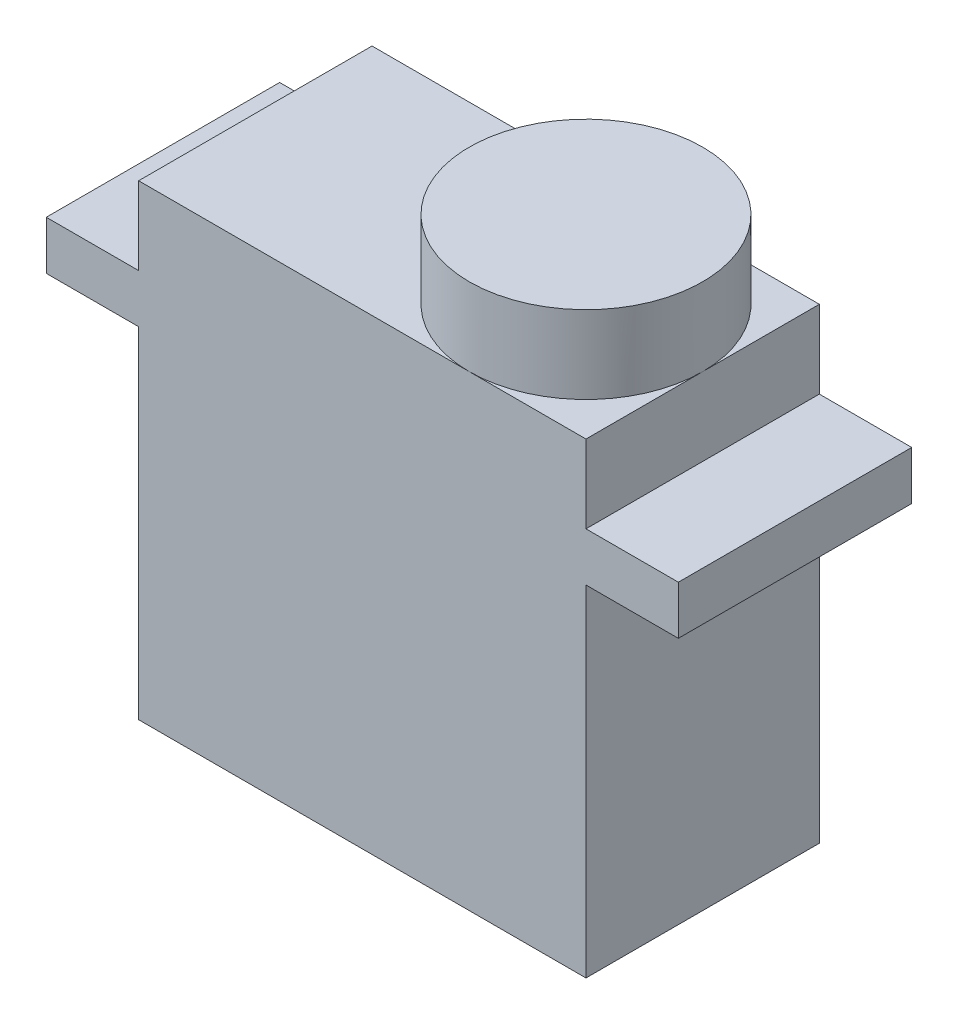
ISO-10303-21;
HEADER;
FILE_DESCRIPTION(('STEP AP214'),'2;1');
FILE_NAME('part.step','',(''),(''),'','','');
FILE_SCHEMA(('AUTOMOTIVE_DESIGN { 1 0 10303 214 1 1 1 1 }'));
ENDSEC;
DATA;
#1=APPLICATION_CONTEXT('core data for automotive mechanical design processes');
#2=APPLICATION_PROTOCOL_DEFINITION('international standard','automotive_design',2000,#1);
#3=PRODUCT_CONTEXT('',#1,'mechanical');
#4=PRODUCT('Part','Part','',(#3));
#5=PRODUCT_RELATED_PRODUCT_CATEGORY('part','',(#4));
#6=PRODUCT_DEFINITION_FORMATION('','',#4);
#7=PRODUCT_DEFINITION_CONTEXT('part definition',#1,'design');
#8=PRODUCT_DEFINITION('design','',#6,#7);
#9=PRODUCT_DEFINITION_SHAPE('','',#8);
#10=(LENGTH_UNIT() NAMED_UNIT(*) SI_UNIT(.MILLI.,.METRE.));
#11=(NAMED_UNIT(*) PLANE_ANGLE_UNIT() SI_UNIT($,.RADIAN.));
#12=(NAMED_UNIT(*) SI_UNIT($,.STERADIAN.) SOLID_ANGLE_UNIT());
#13=UNCERTAINTY_MEASURE_WITH_UNIT(LENGTH_MEASURE(1.E-05),#10,'distance_accuracy_value','');
#14=(GEOMETRIC_REPRESENTATION_CONTEXT(3) GLOBAL_UNCERTAINTY_ASSIGNED_CONTEXT((#13)) GLOBAL_UNIT_ASSIGNED_CONTEXT((#10,
#11,#12)) REPRESENTATION_CONTEXT('',''));
#15=CARTESIAN_POINT('',(0.,0.,0.));
#16=DIRECTION('',(0.,0.,1.));
#17=DIRECTION('',(1.,0.,0.));
#18=AXIS2_PLACEMENT_3D('',#15,#16,#17);
#19=CARTESIAN_POINT('',(11.5,24.,0.));
#20=DIRECTION('',(-1.,0.,0.));
#21=DIRECTION('',(0.,0.,1.));
#22=AXIS2_PLACEMENT_3D('',#19,#20,#21);
#23=PLANE('',#22);
#24=DIRECTION('',(0.,0.,-1.));
#25=VECTOR('',#24,1.);
#26=CARTESIAN_POINT('',(11.5,17.5,0.));
#27=LINE('',#26,#25);
#28=CARTESIAN_POINT('',(11.5,17.5,6.));
#29=VERTEX_POINT('',#28);
#30=CARTESIAN_POINT('',(11.5,17.5,-6.));
#31=VERTEX_POINT('',#30);
#32=EDGE_CURVE('E152',#29,#31,#27,.T.);
#33=ORIENTED_EDGE('',*,*,#32,.F.);
#34=DIRECTION('',(0.,-1.,0.));
#35=VECTOR('',#34,1.);
#36=CARTESIAN_POINT('',(11.5,24.,6.));
#37=LINE('',#36,#35);
#38=CARTESIAN_POINT('',(11.5,0.,6.));
#39=VERTEX_POINT('',#38);
#40=EDGE_CURVE('E161',#29,#39,#37,.T.);
#41=ORIENTED_EDGE('',*,*,#40,.T.);
#42=DIRECTION('',(0.,0.,-1.));
#43=VECTOR('',#42,1.);
#44=CARTESIAN_POINT('',(11.5,0.,0.));
#45=LINE('',#44,#43);
#46=CARTESIAN_POINT('',(11.5,0.,-6.));
#47=VERTEX_POINT('',#46);
#48=EDGE_CURVE('E218',#39,#47,#45,.T.);
#49=ORIENTED_EDGE('',*,*,#48,.T.);
#50=DIRECTION('',(0.,-1.,0.));
#51=VECTOR('',#50,1.);
#52=CARTESIAN_POINT('',(11.5,24.,-6.));
#53=LINE('',#52,#51);
#54=EDGE_CURVE('E233',#31,#47,#53,.T.);
#55=ORIENTED_EDGE('',*,*,#54,.F.);
#56=EDGE_LOOP('',(#33,#41,#49,#55));
#57=FACE_BOUND('',#56,.T.);
#58=ADVANCED_FACE('F39',(#57),#23,.F.);
#59=CARTESIAN_POINT('',(-11.5,24.,0.));
#60=DIRECTION('',(-1.,0.,0.));
#61=DIRECTION('',(0.,0.,1.));
#62=AXIS2_PLACEMENT_3D('',#59,#60,#61);
#63=PLANE('',#62);
#64=DIRECTION('',(0.,-1.,0.));
#65=VECTOR('',#64,1.);
#66=CARTESIAN_POINT('',(-11.5,24.,6.));
#67=LINE('',#66,#65);
#68=CARTESIAN_POINT('',(-11.5,17.5,6.));
#69=VERTEX_POINT('',#68);
#70=CARTESIAN_POINT('',(-11.5,0.,6.));
#71=VERTEX_POINT('',#70);
#72=EDGE_CURVE('E216',#69,#71,#67,.T.);
#73=ORIENTED_EDGE('',*,*,#72,.F.);
#74=DIRECTION('',(0.,0.,-1.));
#75=VECTOR('',#74,1.);
#76=CARTESIAN_POINT('',(-11.5,17.5,0.));
#77=LINE('',#76,#75);
#78=CARTESIAN_POINT('',(-11.5,17.5,-6.));
#79=VERTEX_POINT('',#78);
#80=EDGE_CURVE('E183',#69,#79,#77,.T.);
#81=ORIENTED_EDGE('',*,*,#80,.T.);
#82=DIRECTION('',(0.,-1.,0.));
#83=VECTOR('',#82,1.);
#84=CARTESIAN_POINT('',(-11.5,24.,-6.));
#85=LINE('',#84,#83);
#86=CARTESIAN_POINT('',(-11.5,0.,-6.));
#87=VERTEX_POINT('',#86);
#88=EDGE_CURVE('E230',#79,#87,#85,.T.);
#89=ORIENTED_EDGE('',*,*,#88,.T.);
#90=DIRECTION('',(0.,0.,-1.));
#91=VECTOR('',#90,1.);
#92=CARTESIAN_POINT('',(-11.5,0.,0.));
#93=LINE('',#92,#91);
#94=EDGE_CURVE('E224',#71,#87,#93,.T.);
#95=ORIENTED_EDGE('',*,*,#94,.F.);
#96=EDGE_LOOP('',(#73,#81,#89,#95));
#97=FACE_BOUND('',#96,.T.);
#98=ADVANCED_FACE('F249',(#97),#63,.T.);
#99=CARTESIAN_POINT('',(0.,24.,0.));
#100=DIRECTION('',(0.,1.,0.));
#101=DIRECTION('',(0.,0.,1.));
#102=AXIS2_PLACEMENT_3D('',#99,#100,#101);
#103=PLANE('',#102);
#104=CARTESIAN_POINT('',(5.5,24.,0.));
#105=DIRECTION('',(0.,1.,0.));
#106=DIRECTION('',(0.,0.,1.));
#107=AXIS2_PLACEMENT_3D('',#104,#105,#106);
#108=CIRCLE('',#107,6.);
#109=CARTESIAN_POINT('',(5.5,24.,6.));
#110=VERTEX_POINT('',#109);
#111=CARTESIAN_POINT('',(11.5,24.,0.));
#112=VERTEX_POINT('',#111);
#113=EDGE_CURVE('E50',#110,#112,#108,.T.);
#114=ORIENTED_EDGE('',*,*,#113,.F.);
#115=DIRECTION('',(1.,0.,0.));
#116=VECTOR('',#115,1.);
#117=CARTESIAN_POINT('',(0.,24.,6.));
#118=LINE('',#117,#116);
#119=CARTESIAN_POINT('',(11.5,24.,6.));
#120=VERTEX_POINT('',#119);
#121=EDGE_CURVE('E205',#110,#120,#118,.T.);
#122=ORIENTED_EDGE('',*,*,#121,.T.);
#123=DIRECTION('',(0.,0.,-1.));
#124=VECTOR('',#123,1.);
#125=CARTESIAN_POINT('',(11.5,24.,0.));
#126=LINE('',#125,#124);
#127=EDGE_CURVE('E206',#120,#112,#126,.T.);
#128=ORIENTED_EDGE('',*,*,#127,.T.);
#129=EDGE_LOOP('',(#114,#122,#128));
#130=FACE_BOUND('',#129,.T.);
#131=ADVANCED_FACE('F283',(#130),#103,.T.);
#132=CARTESIAN_POINT('',(5.5,24.,-6.));
#133=VERTEX_POINT('',#132);
#134=EDGE_CURVE('E11',#112,#133,#108,.T.);
#135=ORIENTED_EDGE('',*,*,#134,.F.);
#136=CARTESIAN_POINT('',(11.5,24.,-6.));
#137=VERTEX_POINT('',#136);
#138=EDGE_CURVE('E204',#112,#137,#126,.T.);
#139=ORIENTED_EDGE('',*,*,#138,.T.);
#140=DIRECTION('',(1.,0.,0.));
#141=VECTOR('',#140,1.);
#142=CARTESIAN_POINT('',(0.,24.,-6.));
#143=LINE('',#142,#141);
#144=EDGE_CURVE('E209',#133,#137,#143,.T.);
#145=ORIENTED_EDGE('',*,*,#144,.F.);
#146=EDGE_LOOP('',(#135,#139,#145));
#147=FACE_BOUND('',#146,.T.);
#148=ADVANCED_FACE('F272',(#147),#103,.T.);
#149=CARTESIAN_POINT('',(0.,24.,6.));
#150=DIRECTION('',(0.,0.,-1.));
#151=DIRECTION('',(-1.,0.,0.));
#152=AXIS2_PLACEMENT_3D('',#149,#150,#151);
#153=PLANE('',#152);
#154=DIRECTION('',(1.,0.,0.));
#155=VECTOR('',#154,1.);
#156=CARTESIAN_POINT('',(0.,0.,6.));
#157=LINE('',#156,#155);
#158=EDGE_CURVE('E199',#71,#39,#157,.T.);
#159=ORIENTED_EDGE('',*,*,#158,.T.);
#160=ORIENTED_EDGE('',*,*,#40,.F.);
#161=DIRECTION('',(1.,0.,0.));
#162=VECTOR('',#161,1.);
#163=CARTESIAN_POINT('',(0.,17.5,6.));
#164=LINE('',#163,#162);
#165=CARTESIAN_POINT('',(16.25,17.5,6.));
#166=VERTEX_POINT('',#165);
#167=EDGE_CURVE('E156',#29,#166,#164,.T.);
#168=ORIENTED_EDGE('',*,*,#167,.T.);
#169=DIRECTION('',(0.,1.,0.));
#170=VECTOR('',#169,1.);
#171=CARTESIAN_POINT('',(16.25,17.5,6.));
#172=LINE('',#171,#170);
#173=CARTESIAN_POINT('',(16.25,20.,6.));
#174=VERTEX_POINT('',#173);
#175=EDGE_CURVE('E141',#166,#174,#172,.T.);
#176=ORIENTED_EDGE('',*,*,#175,.T.);
#177=DIRECTION('',(1.,0.,0.));
#178=VECTOR('',#177,1.);
#179=CARTESIAN_POINT('',(0.,20.,6.));
#180=LINE('',#179,#178);
#181=CARTESIAN_POINT('',(11.5,20.,6.));
#182=VERTEX_POINT('',#181);
#183=EDGE_CURVE('E170',#182,#174,#180,.T.);
#184=ORIENTED_EDGE('',*,*,#183,.F.);
#185=EDGE_CURVE('E43',#120,#182,#37,.T.);
#186=ORIENTED_EDGE('',*,*,#185,.F.);
#187=ORIENTED_EDGE('',*,*,#121,.F.);
#188=CARTESIAN_POINT('',(-11.5,24.,6.));
#189=VERTEX_POINT('',#188);
#190=EDGE_CURVE('E202',#189,#110,#118,.T.);
#191=ORIENTED_EDGE('',*,*,#190,.F.);
#192=CARTESIAN_POINT('',(-11.5,20.,6.));
#193=VERTEX_POINT('',#192);
#194=EDGE_CURVE('E227',#189,#193,#67,.T.);
#195=ORIENTED_EDGE('',*,*,#194,.T.);
#196=DIRECTION('',(1.,0.,0.));
#197=VECTOR('',#196,1.);
#198=CARTESIAN_POINT('',(0.,20.,6.));
#199=LINE('',#198,#197);
#200=CARTESIAN_POINT('',(-16.25,20.,6.));
#201=VERTEX_POINT('',#200);
#202=EDGE_CURVE('E189',#201,#193,#199,.T.);
#203=ORIENTED_EDGE('',*,*,#202,.F.);
#204=DIRECTION('',(0.,1.,0.));
#205=VECTOR('',#204,1.);
#206=CARTESIAN_POINT('',(-16.25,17.5,6.));
#207=LINE('',#206,#205);
#208=CARTESIAN_POINT('',(-16.25,17.5,6.));
#209=VERTEX_POINT('',#208);
#210=EDGE_CURVE('E193',#209,#201,#207,.T.);
#211=ORIENTED_EDGE('',*,*,#210,.F.);
#212=DIRECTION('',(1.,0.,0.));
#213=VECTOR('',#212,1.);
#214=CARTESIAN_POINT('',(0.,17.5,6.));
#215=LINE('',#214,#213);
#216=EDGE_CURVE('E181',#209,#69,#215,.T.);
#217=ORIENTED_EDGE('',*,*,#216,.T.);
#218=ORIENTED_EDGE('',*,*,#72,.T.);
#219=EDGE_LOOP('',(#159,#160,#168,#176,#184,#186,#187,#191,#195,#203,#211,#217,#218));
#220=FACE_BOUND('',#219,.T.);
#221=ADVANCED_FACE('F41',(#220),#153,.F.);
#222=ORIENTED_EDGE('',*,*,#185,.T.);
#223=DIRECTION('',(0.,0.,-1.));
#224=VECTOR('',#223,1.);
#225=CARTESIAN_POINT('',(11.5,20.,0.));
#226=LINE('',#225,#224);
#227=CARTESIAN_POINT('',(11.5,20.,-6.));
#228=VERTEX_POINT('',#227);
#229=EDGE_CURVE('E162',#182,#228,#226,.T.);
#230=ORIENTED_EDGE('',*,*,#229,.T.);
#231=EDGE_CURVE('E234',#137,#228,#53,.T.);
#232=ORIENTED_EDGE('',*,*,#231,.F.);
#233=ORIENTED_EDGE('',*,*,#138,.F.);
#234=ORIENTED_EDGE('',*,*,#127,.F.);
#235=EDGE_LOOP('',(#222,#230,#232,#233,#234));
#236=FACE_BOUND('',#235,.T.);
#237=ADVANCED_FACE('F277',(#236),#23,.F.);
#238=CARTESIAN_POINT('',(0.,24.,-6.));
#239=DIRECTION('',(0.,0.,-1.));
#240=DIRECTION('',(-1.,0.,0.));
#241=AXIS2_PLACEMENT_3D('',#238,#239,#240);
#242=PLANE('',#241);
#243=DIRECTION('',(1.,0.,0.));
#244=VECTOR('',#243,1.);
#245=CARTESIAN_POINT('',(0.,0.,-6.));
#246=LINE('',#245,#244);
#247=EDGE_CURVE('E221',#87,#47,#246,.T.);
#248=ORIENTED_EDGE('',*,*,#247,.F.);
#249=ORIENTED_EDGE('',*,*,#88,.F.);
#250=DIRECTION('',(1.,0.,0.));
#251=VECTOR('',#250,1.);
#252=CARTESIAN_POINT('',(0.,17.5,-6.));
#253=LINE('',#252,#251);
#254=CARTESIAN_POINT('',(-16.25,17.5,-6.));
#255=VERTEX_POINT('',#254);
#256=EDGE_CURVE('E65',#255,#79,#253,.T.);
#257=ORIENTED_EDGE('',*,*,#256,.F.);
#258=DIRECTION('',(0.,1.,0.));
#259=VECTOR('',#258,1.);
#260=CARTESIAN_POINT('',(-16.25,17.5,-6.));
#261=LINE('',#260,#259);
#262=CARTESIAN_POINT('',(-16.25,20.,-6.));
#263=VERTEX_POINT('',#262);
#264=EDGE_CURVE('E185',#255,#263,#261,.T.);
#265=ORIENTED_EDGE('',*,*,#264,.T.);
#266=DIRECTION('',(1.,0.,0.));
#267=VECTOR('',#266,1.);
#268=CARTESIAN_POINT('',(0.,20.,-6.));
#269=LINE('',#268,#267);
#270=CARTESIAN_POINT('',(-11.5,20.,-6.));
#271=VERTEX_POINT('',#270);
#272=EDGE_CURVE('E175',#263,#271,#269,.T.);
#273=ORIENTED_EDGE('',*,*,#272,.T.);
#274=CARTESIAN_POINT('',(-11.5,24.,-6.));
#275=VERTEX_POINT('',#274);
#276=EDGE_CURVE('E231',#275,#271,#85,.T.);
#277=ORIENTED_EDGE('',*,*,#276,.F.);
#278=EDGE_CURVE('E210',#275,#133,#143,.T.);
#279=ORIENTED_EDGE('',*,*,#278,.T.);
#280=ORIENTED_EDGE('',*,*,#144,.T.);
#281=ORIENTED_EDGE('',*,*,#231,.T.);
#282=DIRECTION('',(1.,0.,0.));
#283=VECTOR('',#282,1.);
#284=CARTESIAN_POINT('',(0.,20.,-6.));
#285=LINE('',#284,#283);
#286=CARTESIAN_POINT('',(16.25,20.,-6.));
#287=VERTEX_POINT('',#286);
#288=EDGE_CURVE('E165',#228,#287,#285,.T.);
#289=ORIENTED_EDGE('',*,*,#288,.T.);
#290=DIRECTION('',(0.,1.,0.));
#291=VECTOR('',#290,1.);
#292=CARTESIAN_POINT('',(16.25,17.5,-6.));
#293=LINE('',#292,#291);
#294=CARTESIAN_POINT('',(16.25,17.5,-6.));
#295=VERTEX_POINT('',#294);
#296=EDGE_CURVE('E151',#295,#287,#293,.T.);
#297=ORIENTED_EDGE('',*,*,#296,.F.);
#298=DIRECTION('',(1.,0.,0.));
#299=VECTOR('',#298,1.);
#300=CARTESIAN_POINT('',(0.,17.5,-6.));
#301=LINE('',#300,#299);
#302=EDGE_CURVE('E57',#31,#295,#301,.T.);
#303=ORIENTED_EDGE('',*,*,#302,.F.);
#304=ORIENTED_EDGE('',*,*,#54,.T.);
#305=EDGE_LOOP('',(#248,#249,#257,#265,#273,#277,#279,#280,#281,#289,#297,#303,#304));
#306=FACE_BOUND('',#305,.T.);
#307=ADVANCED_FACE('F239',(#306),#242,.T.);
#308=DIRECTION('',(0.,0.,-1.));
#309=VECTOR('',#308,1.);
#310=CARTESIAN_POINT('',(-11.5,20.,0.));
#311=LINE('',#310,#309);
#312=EDGE_CURVE('E179',#193,#271,#311,.T.);
#313=ORIENTED_EDGE('',*,*,#312,.F.);
#314=ORIENTED_EDGE('',*,*,#194,.F.);
#315=DIRECTION('',(0.,0.,-1.));
#316=VECTOR('',#315,1.);
#317=CARTESIAN_POINT('',(-11.5,24.,0.));
#318=LINE('',#317,#316);
#319=EDGE_CURVE('E213',#189,#275,#318,.T.);
#320=ORIENTED_EDGE('',*,*,#319,.T.);
#321=ORIENTED_EDGE('',*,*,#276,.T.);
#322=EDGE_LOOP('',(#313,#314,#320,#321));
#323=FACE_BOUND('',#322,.T.);
#324=ADVANCED_FACE('F260',(#323),#63,.T.);
#325=EDGE_CURVE('E48',#133,#110,#108,.T.);
#326=ORIENTED_EDGE('',*,*,#325,.F.);
#327=ORIENTED_EDGE('',*,*,#278,.F.);
#328=ORIENTED_EDGE('',*,*,#319,.F.);
#329=ORIENTED_EDGE('',*,*,#190,.T.);
#330=EDGE_LOOP('',(#326,#327,#328,#329));
#331=FACE_BOUND('',#330,.T.);
#332=ADVANCED_FACE('F264',(#331),#103,.T.);
#333=CARTESIAN_POINT('',(0.,0.,0.));
#334=DIRECTION('',(0.,1.,0.));
#335=DIRECTION('',(0.,0.,1.));
#336=AXIS2_PLACEMENT_3D('',#333,#334,#335);
#337=PLANE('',#336);
#338=ORIENTED_EDGE('',*,*,#158,.F.);
#339=ORIENTED_EDGE('',*,*,#94,.T.);
#340=ORIENTED_EDGE('',*,*,#247,.T.);
#341=ORIENTED_EDGE('',*,*,#48,.F.);
#342=EDGE_LOOP('',(#338,#339,#340,#341));
#343=FACE_BOUND('',#342,.T.);
#344=ADVANCED_FACE('F245',(#343),#337,.F.);
#345=CARTESIAN_POINT('',(5.5,28.,0.));
#346=DIRECTION('',(0.,-1.,0.));
#347=DIRECTION('',(0.,0.,-1.));
#348=AXIS2_PLACEMENT_3D('',#345,#346,#347);
#349=CYLINDRICAL_SURFACE('',#348,6.);
#350=CARTESIAN_POINT('',(5.5,28.,0.));
#351=DIRECTION('',(0.,1.,0.));
#352=DIRECTION('',(0.,0.,1.));
#353=AXIS2_PLACEMENT_3D('',#350,#351,#352);
#354=CIRCLE('',#353,6.);
#355=CARTESIAN_POINT('',(5.5,28.,6.));
#356=VERTEX_POINT('',#355);
#357=EDGE_CURVE('E197',#356,#356,#354,.T.);
#358=ORIENTED_EDGE('',*,*,#357,.F.);
#359=EDGE_LOOP('',(#358));
#360=FACE_BOUND('',#359,.T.);
#361=ORIENTED_EDGE('',*,*,#113,.T.);
#362=ORIENTED_EDGE('',*,*,#134,.T.);
#363=ORIENTED_EDGE('',*,*,#325,.T.);
#364=EDGE_LOOP('',(#361,#362,#363));
#365=FACE_BOUND('',#364,.T.);
#366=ADVANCED_FACE('F284',(#360,#365),#349,.T.);
#367=CARTESIAN_POINT('',(5.5,28.,0.));
#368=DIRECTION('',(0.,1.,0.));
#369=DIRECTION('',(0.,0.,1.));
#370=AXIS2_PLACEMENT_3D('',#367,#368,#369);
#371=PLANE('',#370);
#372=ORIENTED_EDGE('',*,*,#357,.T.);
#373=EDGE_LOOP('',(#372));
#374=FACE_BOUND('',#373,.T.);
#375=ADVANCED_FACE('F286',(#374),#371,.T.);
#376=CARTESIAN_POINT('',(-16.25,17.5,0.));
#377=DIRECTION('',(1.,0.,0.));
#378=DIRECTION('',(0.,0.,-1.));
#379=AXIS2_PLACEMENT_3D('',#376,#377,#378);
#380=PLANE('',#379);
#381=DIRECTION('',(0.,0.,-1.));
#382=VECTOR('',#381,1.);
#383=CARTESIAN_POINT('',(-16.25,20.,0.));
#384=LINE('',#383,#382);
#385=EDGE_CURVE('E187',#201,#263,#384,.T.);
#386=ORIENTED_EDGE('',*,*,#385,.T.);
#387=ORIENTED_EDGE('',*,*,#264,.F.);
#388=DIRECTION('',(0.,0.,-1.));
#389=VECTOR('',#388,1.);
#390=CARTESIAN_POINT('',(-16.25,17.5,0.));
#391=LINE('',#390,#389);
#392=EDGE_CURVE('E178',#209,#255,#391,.T.);
#393=ORIENTED_EDGE('',*,*,#392,.F.);
#394=ORIENTED_EDGE('',*,*,#210,.T.);
#395=EDGE_LOOP('',(#386,#387,#393,#394));
#396=FACE_BOUND('',#395,.T.);
#397=ADVANCED_FACE('F293',(#396),#380,.F.);
#398=CARTESIAN_POINT('',(0.,17.5,0.));
#399=DIRECTION('',(0.,1.,0.));
#400=DIRECTION('',(0.,0.,1.));
#401=AXIS2_PLACEMENT_3D('',#398,#399,#400);
#402=PLANE('',#401);
#403=ORIENTED_EDGE('',*,*,#256,.T.);
#404=ORIENTED_EDGE('',*,*,#80,.F.);
#405=ORIENTED_EDGE('',*,*,#216,.F.);
#406=ORIENTED_EDGE('',*,*,#392,.T.);
#407=EDGE_LOOP('',(#403,#404,#405,#406));
#408=FACE_BOUND('',#407,.T.);
#409=ADVANCED_FACE('F333',(#408),#402,.F.);
#410=CARTESIAN_POINT('',(0.,20.,0.));
#411=DIRECTION('',(0.,1.,0.));
#412=DIRECTION('',(0.,0.,1.));
#413=AXIS2_PLACEMENT_3D('',#410,#411,#412);
#414=PLANE('',#413);
#415=ORIENTED_EDGE('',*,*,#272,.F.);
#416=ORIENTED_EDGE('',*,*,#385,.F.);
#417=ORIENTED_EDGE('',*,*,#202,.T.);
#418=ORIENTED_EDGE('',*,*,#312,.T.);
#419=EDGE_LOOP('',(#415,#416,#417,#418));
#420=FACE_BOUND('',#419,.T.);
#421=ADVANCED_FACE('F256',(#420),#414,.T.);
#422=CARTESIAN_POINT('',(16.25,17.5,0.));
#423=DIRECTION('',(1.,0.,0.));
#424=DIRECTION('',(0.,0.,-1.));
#425=AXIS2_PLACEMENT_3D('',#422,#423,#424);
#426=PLANE('',#425);
#427=DIRECTION('',(0.,0.,-1.));
#428=VECTOR('',#427,1.);
#429=CARTESIAN_POINT('',(16.25,20.,0.));
#430=LINE('',#429,#428);
#431=EDGE_CURVE('E146',#174,#287,#430,.T.);
#432=ORIENTED_EDGE('',*,*,#431,.F.);
#433=ORIENTED_EDGE('',*,*,#175,.F.);
#434=DIRECTION('',(0.,0.,-1.));
#435=VECTOR('',#434,1.);
#436=CARTESIAN_POINT('',(16.25,17.5,0.));
#437=LINE('',#436,#435);
#438=EDGE_CURVE('E144',#166,#295,#437,.T.);
#439=ORIENTED_EDGE('',*,*,#438,.T.);
#440=ORIENTED_EDGE('',*,*,#296,.T.);
#441=EDGE_LOOP('',(#432,#433,#439,#440));
#442=FACE_BOUND('',#441,.T.);
#443=ADVANCED_FACE('F143',(#442),#426,.T.);
#444=CARTESIAN_POINT('',(0.,17.5,0.));
#445=DIRECTION('',(0.,1.,0.));
#446=DIRECTION('',(0.,0.,1.));
#447=AXIS2_PLACEMENT_3D('',#444,#445,#446);
#448=PLANE('',#447);
#449=ORIENTED_EDGE('',*,*,#167,.F.);
#450=ORIENTED_EDGE('',*,*,#32,.T.);
#451=ORIENTED_EDGE('',*,*,#302,.T.);
#452=ORIENTED_EDGE('',*,*,#438,.F.);
#453=EDGE_LOOP('',(#449,#450,#451,#452));
#454=FACE_BOUND('',#453,.T.);
#455=ADVANCED_FACE('F155',(#454),#448,.F.);
#456=CARTESIAN_POINT('',(0.,20.,0.));
#457=DIRECTION('',(0.,1.,0.));
#458=DIRECTION('',(0.,0.,1.));
#459=AXIS2_PLACEMENT_3D('',#456,#457,#458);
#460=PLANE('',#459);
#461=ORIENTED_EDGE('',*,*,#183,.T.);
#462=ORIENTED_EDGE('',*,*,#431,.T.);
#463=ORIENTED_EDGE('',*,*,#288,.F.);
#464=ORIENTED_EDGE('',*,*,#229,.F.);
#465=EDGE_LOOP('',(#461,#462,#463,#464));
#466=FACE_BOUND('',#465,.T.);
#467=ADVANCED_FACE('F280',(#466),#460,.T.);
#468=CLOSED_SHELL('',(#58,#98,#131,#148,#221,#237,#307,#324,#332,#344,#366,#375,#397,#409,#421,
#443,#455,#467));
#469=MANIFOLD_SOLID_BREP('B2',#468);
#470=ADVANCED_BREP_SHAPE_REPRESENTATION('',(#18,#469),#14);
#471=SHAPE_DEFINITION_REPRESENTATION(#9,#470);
ENDSEC;
END-ISO-10303-21;
